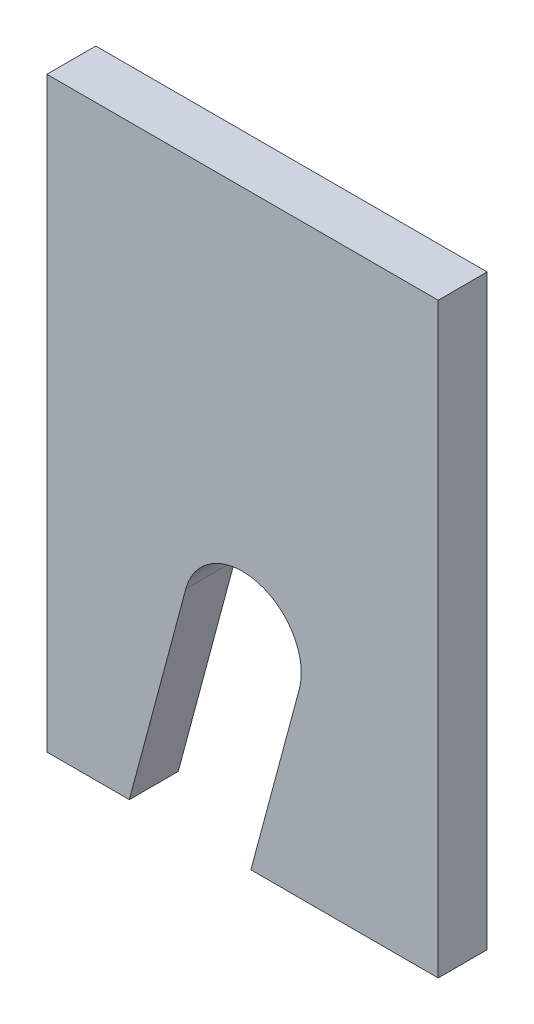
ISO-10303-21;
HEADER;
FILE_DESCRIPTION(('STEP AP214'),'2;1');
FILE_NAME('part.step','',(''),(''),'','','');
FILE_SCHEMA(('AUTOMOTIVE_DESIGN { 1 0 10303 214 1 1 1 1 }'));
ENDSEC;
DATA;
#1=APPLICATION_CONTEXT('core data for automotive mechanical design processes');
#2=APPLICATION_PROTOCOL_DEFINITION('international standard','automotive_design',2000,#1);
#3=PRODUCT_CONTEXT('',#1,'mechanical');
#4=PRODUCT('Part','Part','',(#3));
#5=PRODUCT_RELATED_PRODUCT_CATEGORY('part','',(#4));
#6=PRODUCT_DEFINITION_FORMATION('','',#4);
#7=PRODUCT_DEFINITION_CONTEXT('part definition',#1,'design');
#8=PRODUCT_DEFINITION('design','',#6,#7);
#9=PRODUCT_DEFINITION_SHAPE('','',#8);
#10=(LENGTH_UNIT() NAMED_UNIT(*) SI_UNIT(.MILLI.,.METRE.));
#11=(NAMED_UNIT(*) PLANE_ANGLE_UNIT() SI_UNIT($,.RADIAN.));
#12=(NAMED_UNIT(*) SI_UNIT($,.STERADIAN.) SOLID_ANGLE_UNIT());
#13=UNCERTAINTY_MEASURE_WITH_UNIT(LENGTH_MEASURE(1.E-05),#10,'distance_accuracy_value','');
#14=(GEOMETRIC_REPRESENTATION_CONTEXT(3) GLOBAL_UNCERTAINTY_ASSIGNED_CONTEXT((#13)) GLOBAL_UNIT_ASSIGNED_CONTEXT((#10,
#11,#12)) REPRESENTATION_CONTEXT('',''));
#15=CARTESIAN_POINT('',(0.,0.,0.));
#16=DIRECTION('',(0.,0.,1.));
#17=DIRECTION('',(1.,0.,0.));
#18=AXIS2_PLACEMENT_3D('',#15,#16,#17);
#19=CARTESIAN_POINT('',(25.4,25.4,6.35));
#20=DIRECTION('',(0.,0.,-1.));
#21=DIRECTION('',(-1.,0.,0.));
#22=AXIS2_PLACEMENT_3D('',#19,#20,#21);
#23=CYLINDRICAL_SURFACE('',#22,7.62);
#24=CARTESIAN_POINT('',(25.4,25.4,0.));
#25=DIRECTION('',(0.,0.,1.));
#26=DIRECTION('',(1.,0.,0.));
#27=AXIS2_PLACEMENT_3D('',#24,#25,#26);
#28=CIRCLE('',#27,7.62);
#29=CARTESIAN_POINT('',(32.7603547963227,23.4277988763188,0.));
#30=VERTEX_POINT('',#29);
#31=CARTESIAN_POINT('',(18.0396452036773,27.3722011236812,0.));
#32=VERTEX_POINT('',#31);
#33=EDGE_CURVE('E137',#30,#32,#28,.T.);
#34=ORIENTED_EDGE('',*,*,#33,.F.);
#35=DIRECTION('',(0.,0.,-1.));
#36=VECTOR('',#35,1.);
#37=CARTESIAN_POINT('',(32.7603547963227,23.4277988763188,6.35));
#38=LINE('',#37,#36);
#39=CARTESIAN_POINT('',(32.7603547963227,23.4277988763188,6.35));
#40=VERTEX_POINT('',#39);
#41=EDGE_CURVE('E11',#40,#30,#38,.T.);
#42=ORIENTED_EDGE('',*,*,#41,.F.);
#43=CARTESIAN_POINT('',(25.4,25.4,6.35));
#44=DIRECTION('',(0.,0.,1.));
#45=DIRECTION('',(1.,0.,0.));
#46=AXIS2_PLACEMENT_3D('',#43,#44,#45);
#47=CIRCLE('',#46,7.62);
#48=CARTESIAN_POINT('',(18.0396452036773,27.3722011236812,6.35));
#49=VERTEX_POINT('',#48);
#50=EDGE_CURVE('E155',#40,#49,#47,.T.);
#51=ORIENTED_EDGE('',*,*,#50,.T.);
#52=DIRECTION('',(0.,0.,-1.));
#53=VECTOR('',#52,1.);
#54=CARTESIAN_POINT('',(18.0396452036773,27.3722011236812,6.35));
#55=LINE('',#54,#53);
#56=EDGE_CURVE('E58',#49,#32,#55,.T.);
#57=ORIENTED_EDGE('',*,*,#56,.T.);
#58=EDGE_LOOP('',(#34,#42,#51,#57));
#59=FACE_BOUND('',#58,.T.);
#60=ADVANCED_FACE('F42',(#59),#23,.F.);
#61=CARTESIAN_POINT('',(24.7088774243849,-6.62072375174364,6.35));
#62=DIRECTION('',(0.965925826289067,-0.258819045102525,0.));
#63=DIRECTION('',(0.258819045102525,0.965925826289067,0.));
#64=AXIS2_PLACEMENT_3D('',#61,#62,#63);
#65=PLANE('',#64);
#66=DIRECTION('',(-0.258819045102525,-0.965925826289067,0.));
#67=VECTOR('',#66,1.);
#68=CARTESIAN_POINT('',(24.7088774243849,-6.62072375174364,0.));
#69=LINE('',#68,#67);
#70=CARTESIAN_POINT('',(26.4828950069742,0.,0.));
#71=VERTEX_POINT('',#70);
#72=EDGE_CURVE('E139',#30,#71,#69,.T.);
#73=ORIENTED_EDGE('',*,*,#72,.T.);
#74=DIRECTION('',(0.,0.,-1.));
#75=VECTOR('',#74,1.);
#76=CARTESIAN_POINT('',(26.4828950069742,0.,6.35));
#77=LINE('',#76,#75);
#78=CARTESIAN_POINT('',(26.4828950069742,0.,6.35));
#79=VERTEX_POINT('',#78);
#80=EDGE_CURVE('E50',#79,#71,#77,.T.);
#81=ORIENTED_EDGE('',*,*,#80,.F.);
#82=DIRECTION('',(-0.258819045102525,-0.965925826289067,0.));
#83=VECTOR('',#82,1.);
#84=CARTESIAN_POINT('',(24.7088774243849,-6.62072375174364,6.35));
#85=LINE('',#84,#83);
#86=EDGE_CURVE('E181',#40,#79,#85,.T.);
#87=ORIENTED_EDGE('',*,*,#86,.F.);
#88=ORIENTED_EDGE('',*,*,#41,.T.);
#89=EDGE_LOOP('',(#73,#81,#87,#88));
#90=FACE_BOUND('',#89,.T.);
#91=ADVANCED_FACE('F196',(#90),#65,.F.);
#92=CARTESIAN_POINT('',(0.,0.,6.35));
#93=DIRECTION('',(0.,1.,0.));
#94=DIRECTION('',(-1.,0.,0.));
#95=AXIS2_PLACEMENT_3D('',#92,#93,#94);
#96=PLANE('',#95);
#97=DIRECTION('',(1.,0.,0.));
#98=VECTOR('',#97,1.);
#99=CARTESIAN_POINT('',(0.,0.,0.));
#100=LINE('',#99,#98);
#101=CARTESIAN_POINT('',(50.8,0.,0.));
#102=VERTEX_POINT('',#101);
#103=EDGE_CURVE('E141',#71,#102,#100,.T.);
#104=ORIENTED_EDGE('',*,*,#103,.T.);
#105=DIRECTION('',(0.,0.,-1.));
#106=VECTOR('',#105,1.);
#107=CARTESIAN_POINT('',(50.8,0.,6.35));
#108=LINE('',#107,#106);
#109=CARTESIAN_POINT('',(50.8,0.,6.35));
#110=VERTEX_POINT('',#109);
#111=EDGE_CURVE('E161',#110,#102,#108,.T.);
#112=ORIENTED_EDGE('',*,*,#111,.F.);
#113=DIRECTION('',(1.,0.,0.));
#114=VECTOR('',#113,1.);
#115=CARTESIAN_POINT('',(0.,0.,6.35));
#116=LINE('',#115,#114);
#117=EDGE_CURVE('E170',#79,#110,#116,.T.);
#118=ORIENTED_EDGE('',*,*,#117,.F.);
#119=ORIENTED_EDGE('',*,*,#80,.T.);
#120=EDGE_LOOP('',(#104,#112,#118,#119));
#121=FACE_BOUND('',#120,.T.);
#122=ADVANCED_FACE('F168',(#121),#96,.F.);
#123=CARTESIAN_POINT('',(50.8,0.,6.35));
#124=DIRECTION('',(-1.,0.,0.));
#125=DIRECTION('',(0.,0.,1.));
#126=AXIS2_PLACEMENT_3D('',#123,#124,#125);
#127=PLANE('',#126);
#128=DIRECTION('',(0.,1.,0.));
#129=VECTOR('',#128,1.);
#130=CARTESIAN_POINT('',(50.8,0.,0.));
#131=LINE('',#130,#129);
#132=CARTESIAN_POINT('',(50.8,76.2,0.));
#133=VERTEX_POINT('',#132);
#134=EDGE_CURVE('E143',#102,#133,#131,.T.);
#135=ORIENTED_EDGE('',*,*,#134,.T.);
#136=DIRECTION('',(0.,0.,-1.));
#137=VECTOR('',#136,1.);
#138=CARTESIAN_POINT('',(50.8,76.2,6.35));
#139=LINE('',#138,#137);
#140=CARTESIAN_POINT('',(50.8,76.2,6.35));
#141=VERTEX_POINT('',#140);
#142=EDGE_CURVE('E159',#141,#133,#139,.T.);
#143=ORIENTED_EDGE('',*,*,#142,.F.);
#144=DIRECTION('',(0.,1.,0.));
#145=VECTOR('',#144,1.);
#146=CARTESIAN_POINT('',(50.8,0.,6.35));
#147=LINE('',#146,#145);
#148=EDGE_CURVE('E132',#110,#141,#147,.T.);
#149=ORIENTED_EDGE('',*,*,#148,.F.);
#150=ORIENTED_EDGE('',*,*,#111,.T.);
#151=EDGE_LOOP('',(#135,#143,#149,#150));
#152=FACE_BOUND('',#151,.T.);
#153=ADVANCED_FACE('F179',(#152),#127,.F.);
#154=CARTESIAN_POINT('',(0.,76.2,6.35));
#155=DIRECTION('',(0.,1.,0.));
#156=DIRECTION('',(0.,0.,1.));
#157=AXIS2_PLACEMENT_3D('',#154,#155,#156);
#158=PLANE('',#157);
#159=DIRECTION('',(1.,0.,0.));
#160=VECTOR('',#159,1.);
#161=CARTESIAN_POINT('',(0.,76.2,0.));
#162=LINE('',#161,#160);
#163=CARTESIAN_POINT('',(0.,76.2,0.));
#164=VERTEX_POINT('',#163);
#165=EDGE_CURVE('E146',#164,#133,#162,.T.);
#166=ORIENTED_EDGE('',*,*,#165,.F.);
#167=DIRECTION('',(0.,0.,-1.));
#168=VECTOR('',#167,1.);
#169=CARTESIAN_POINT('',(0.,76.2,6.35));
#170=LINE('',#169,#168);
#171=CARTESIAN_POINT('',(0.,76.2,6.35));
#172=VERTEX_POINT('',#171);
#173=EDGE_CURVE('E118',#172,#164,#170,.T.);
#174=ORIENTED_EDGE('',*,*,#173,.F.);
#175=DIRECTION('',(1.,0.,0.));
#176=VECTOR('',#175,1.);
#177=CARTESIAN_POINT('',(0.,76.2,6.35));
#178=LINE('',#177,#176);
#179=EDGE_CURVE('E130',#172,#141,#178,.T.);
#180=ORIENTED_EDGE('',*,*,#179,.T.);
#181=ORIENTED_EDGE('',*,*,#142,.T.);
#182=EDGE_LOOP('',(#166,#174,#180,#181));
#183=FACE_BOUND('',#182,.T.);
#184=ADVANCED_FACE('F207',(#183),#158,.T.);
#185=CARTESIAN_POINT('',(0.,0.,6.35));
#186=DIRECTION('',(-1.,0.,0.));
#187=DIRECTION('',(0.,-1.,0.));
#188=AXIS2_PLACEMENT_3D('',#185,#186,#187);
#189=PLANE('',#188);
#190=DIRECTION('',(0.,1.,0.));
#191=VECTOR('',#190,1.);
#192=CARTESIAN_POINT('',(0.,0.,0.));
#193=LINE('',#192,#191);
#194=CARTESIAN_POINT('',(0.,0.,0.));
#195=VERTEX_POINT('',#194);
#196=EDGE_CURVE('E115',#195,#164,#193,.T.);
#197=ORIENTED_EDGE('',*,*,#196,.F.);
#198=DIRECTION('',(0.,0.,-1.));
#199=VECTOR('',#198,1.);
#200=CARTESIAN_POINT('',(0.,0.,6.35));
#201=LINE('',#200,#199);
#202=CARTESIAN_POINT('',(0.,0.,6.35));
#203=VERTEX_POINT('',#202);
#204=EDGE_CURVE('E109',#203,#195,#201,.T.);
#205=ORIENTED_EDGE('',*,*,#204,.F.);
#206=DIRECTION('',(0.,1.,0.));
#207=VECTOR('',#206,1.);
#208=CARTESIAN_POINT('',(0.,0.,6.35));
#209=LINE('',#208,#207);
#210=EDGE_CURVE('E113',#203,#172,#209,.T.);
#211=ORIENTED_EDGE('',*,*,#210,.T.);
#212=ORIENTED_EDGE('',*,*,#173,.T.);
#213=EDGE_LOOP('',(#197,#205,#211,#212));
#214=FACE_BOUND('',#213,.T.);
#215=ADVANCED_FACE('F111',(#214),#189,.T.);
#216=CARTESIAN_POINT('',(0.,0.,6.35));
#217=DIRECTION('',(0.,1.,0.));
#218=DIRECTION('',(-1.,0.,0.));
#219=AXIS2_PLACEMENT_3D('',#216,#217,#218);
#220=PLANE('',#219);
#221=DIRECTION('',(1.,0.,0.));
#222=VECTOR('',#221,1.);
#223=CARTESIAN_POINT('',(0.,0.,0.));
#224=LINE('',#223,#222);
#225=CARTESIAN_POINT('',(10.7052860175245,0.,0.));
#226=VERTEX_POINT('',#225);
#227=EDGE_CURVE('E150',#195,#226,#224,.T.);
#228=ORIENTED_EDGE('',*,*,#227,.T.);
#229=DIRECTION('',(0.,0.,-1.));
#230=VECTOR('',#229,1.);
#231=CARTESIAN_POINT('',(10.7052860175245,0.,6.35));
#232=LINE('',#231,#230);
#233=CARTESIAN_POINT('',(10.7052860175245,0.,6.35));
#234=VERTEX_POINT('',#233);
#235=EDGE_CURVE('E84',#234,#226,#232,.T.);
#236=ORIENTED_EDGE('',*,*,#235,.F.);
#237=DIRECTION('',(1.,0.,0.));
#238=VECTOR('',#237,1.);
#239=CARTESIAN_POINT('',(0.,0.,6.35));
#240=LINE('',#239,#238);
#241=EDGE_CURVE('E120',#203,#234,#240,.T.);
#242=ORIENTED_EDGE('',*,*,#241,.F.);
#243=ORIENTED_EDGE('',*,*,#204,.T.);
#244=EDGE_LOOP('',(#228,#236,#242,#243));
#245=FACE_BOUND('',#244,.T.);
#246=ADVANCED_FACE('F121',(#245),#220,.F.);
#247=CARTESIAN_POINT('',(9.98816783173952,-2.67632150438117,6.35));
#248=DIRECTION('',(0.965925826289067,-0.258819045102525,0.));
#249=DIRECTION('',(0.258819045102525,0.965925826289067,0.));
#250=AXIS2_PLACEMENT_3D('',#247,#248,#249);
#251=PLANE('',#250);
#252=DIRECTION('',(-0.258819045102525,-0.965925826289067,0.));
#253=VECTOR('',#252,1.);
#254=CARTESIAN_POINT('',(9.98816783173952,-2.67632150438117,0.));
#255=LINE('',#254,#253);
#256=EDGE_CURVE('E152',#32,#226,#255,.T.);
#257=ORIENTED_EDGE('',*,*,#256,.F.);
#258=ORIENTED_EDGE('',*,*,#56,.F.);
#259=DIRECTION('',(-0.258819045102525,-0.965925826289067,0.));
#260=VECTOR('',#259,1.);
#261=CARTESIAN_POINT('',(9.98816783173952,-2.67632150438117,6.35));
#262=LINE('',#261,#260);
#263=EDGE_CURVE('E124',#49,#234,#262,.T.);
#264=ORIENTED_EDGE('',*,*,#263,.T.);
#265=ORIENTED_EDGE('',*,*,#235,.T.);
#266=EDGE_LOOP('',(#257,#258,#264,#265));
#267=FACE_BOUND('',#266,.T.);
#268=ADVANCED_FACE('F185',(#267),#251,.T.);
#269=CARTESIAN_POINT('',(0.,0.,6.35));
#270=DIRECTION('',(0.,0.,1.));
#271=DIRECTION('',(1.,0.,0.));
#272=AXIS2_PLACEMENT_3D('',#269,#270,#271);
#273=PLANE('',#272);
#274=ORIENTED_EDGE('',*,*,#50,.F.);
#275=ORIENTED_EDGE('',*,*,#86,.T.);
#276=ORIENTED_EDGE('',*,*,#117,.T.);
#277=ORIENTED_EDGE('',*,*,#148,.T.);
#278=ORIENTED_EDGE('',*,*,#179,.F.);
#279=ORIENTED_EDGE('',*,*,#210,.F.);
#280=ORIENTED_EDGE('',*,*,#241,.T.);
#281=ORIENTED_EDGE('',*,*,#263,.F.);
#282=EDGE_LOOP('',(#274,#275,#276,#277,#278,#279,#280,#281));
#283=FACE_BOUND('',#282,.T.);
#284=ADVANCED_FACE('F128',(#283),#273,.T.);
#285=CARTESIAN_POINT('',(0.,0.,0.));
#286=DIRECTION('',(0.,0.,1.));
#287=DIRECTION('',(1.,0.,0.));
#288=AXIS2_PLACEMENT_3D('',#285,#286,#287);
#289=PLANE('',#288);
#290=ORIENTED_EDGE('',*,*,#33,.T.);
#291=ORIENTED_EDGE('',*,*,#256,.T.);
#292=ORIENTED_EDGE('',*,*,#227,.F.);
#293=ORIENTED_EDGE('',*,*,#196,.T.);
#294=ORIENTED_EDGE('',*,*,#165,.T.);
#295=ORIENTED_EDGE('',*,*,#134,.F.);
#296=ORIENTED_EDGE('',*,*,#103,.F.);
#297=ORIENTED_EDGE('',*,*,#72,.F.);
#298=EDGE_LOOP('',(#290,#291,#292,#293,#294,#295,#296,#297));
#299=FACE_BOUND('',#298,.T.);
#300=ADVANCED_FACE('F175',(#299),#289,.F.);
#301=CLOSED_SHELL('',(#60,#91,#122,#153,#184,#215,#246,#268,#284,#300));
#302=MANIFOLD_SOLID_BREP('B2',#301);
#303=ADVANCED_BREP_SHAPE_REPRESENTATION('',(#18,#302),#14);
#304=SHAPE_DEFINITION_REPRESENTATION(#9,#303);
ENDSEC;
END-ISO-10303-21;
